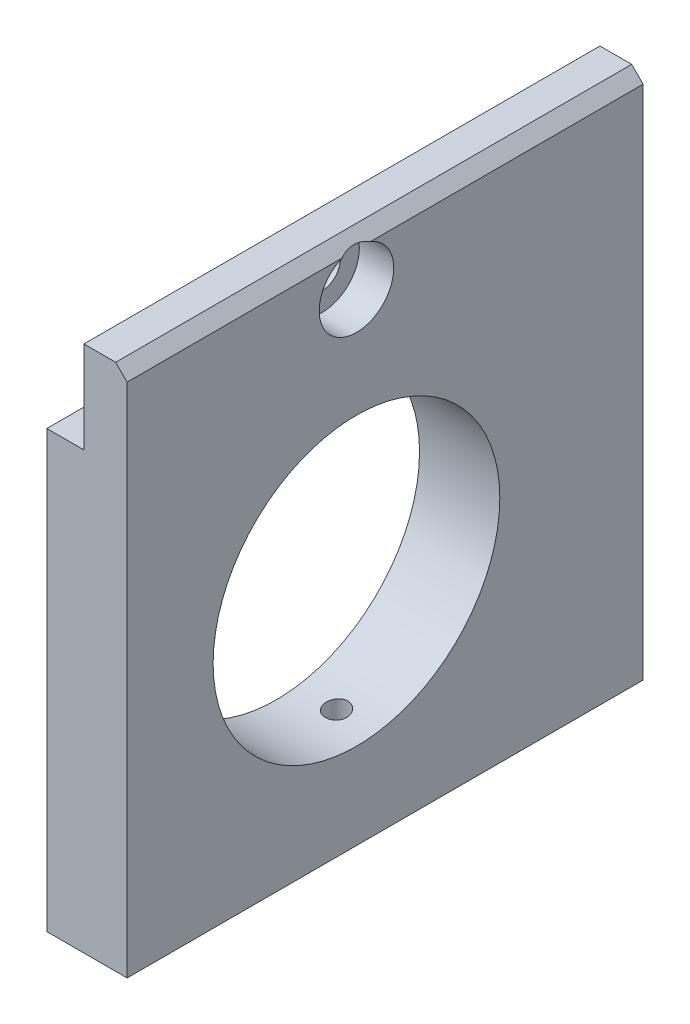
ISO-10303-21;
HEADER;
FILE_DESCRIPTION(('STEP AP214'),'2;1');
FILE_NAME('part.step','',(''),(''),'','','');
FILE_SCHEMA(('AUTOMOTIVE_DESIGN { 1 0 10303 214 1 1 1 1 }'));
ENDSEC;
DATA;
#1=APPLICATION_CONTEXT('core data for automotive mechanical design processes');
#2=APPLICATION_PROTOCOL_DEFINITION('international standard','automotive_design',2000,#1);
#3=PRODUCT_CONTEXT('',#1,'mechanical');
#4=PRODUCT('Part','Part','',(#3));
#5=PRODUCT_RELATED_PRODUCT_CATEGORY('part','',(#4));
#6=PRODUCT_DEFINITION_FORMATION('','',#4);
#7=PRODUCT_DEFINITION_CONTEXT('part definition',#1,'design');
#8=PRODUCT_DEFINITION('design','',#6,#7);
#9=PRODUCT_DEFINITION_SHAPE('','',#8);
#10=(LENGTH_UNIT() NAMED_UNIT(*) SI_UNIT(.MILLI.,.METRE.));
#11=(NAMED_UNIT(*) PLANE_ANGLE_UNIT() SI_UNIT($,.RADIAN.));
#12=(NAMED_UNIT(*) SI_UNIT($,.STERADIAN.) SOLID_ANGLE_UNIT());
#13=UNCERTAINTY_MEASURE_WITH_UNIT(LENGTH_MEASURE(1.E-05),#10,'distance_accuracy_value','');
#14=(GEOMETRIC_REPRESENTATION_CONTEXT(3) GLOBAL_UNCERTAINTY_ASSIGNED_CONTEXT((#13)) GLOBAL_UNIT_ASSIGNED_CONTEXT((#10,
#11,#12)) REPRESENTATION_CONTEXT('',''));
#15=CARTESIAN_POINT('',(0.,0.,0.));
#16=DIRECTION('',(0.,0.,1.));
#17=DIRECTION('',(1.,0.,0.));
#18=AXIS2_PLACEMENT_3D('',#15,#16,#17);
#19=CARTESIAN_POINT('',(0.,-15.6372549019608,45.));
#20=DIRECTION('',(0.,1.,0.));
#21=DIRECTION('',(0.,0.,1.));
#22=AXIS2_PLACEMENT_3D('',#19,#20,#21);
#23=PLANE('',#22);
#24=CARTESIAN_POINT('',(3.5,-15.6372549019608,38.));
#25=DIRECTION('',(0.,-1.,0.));
#26=DIRECTION('',(0.,0.,-1.));
#27=AXIS2_PLACEMENT_3D('',#24,#25,#26);
#28=CIRCLE('',#27,1.49999999999999);
#29=CARTESIAN_POINT('',(3.5,-15.6372549019608,36.5));
#30=VERTEX_POINT('',#29);
#31=EDGE_CURVE('E127',#30,#30,#28,.T.);
#32=ORIENTED_EDGE('',*,*,#31,.F.);
#33=EDGE_LOOP('',(#32));
#34=FACE_BOUND('',#33,.T.);
#35=CARTESIAN_POINT('',(3.5,-15.6372549019608,7.));
#36=DIRECTION('',(0.,-1.,0.));
#37=DIRECTION('',(0.,0.,-1.));
#38=AXIS2_PLACEMENT_3D('',#35,#36,#37);
#39=CIRCLE('',#38,1.49999999999999);
#40=CARTESIAN_POINT('',(3.5,-15.6372549019608,5.50000000000001));
#41=VERTEX_POINT('',#40);
#42=EDGE_CURVE('E126',#41,#41,#39,.T.);
#43=ORIENTED_EDGE('',*,*,#42,.F.);
#44=EDGE_LOOP('',(#43));
#45=FACE_BOUND('',#44,.T.);
#46=DIRECTION('',(1.,0.,0.));
#47=VECTOR('',#46,1.);
#48=CARTESIAN_POINT('',(0.,-15.6372549019608,0.));
#49=LINE('',#48,#47);
#50=CARTESIAN_POINT('',(0.,-15.6372549019608,0.));
#51=VERTEX_POINT('',#50);
#52=CARTESIAN_POINT('',(7.,-15.6372549019608,0.));
#53=VERTEX_POINT('',#52);
#54=EDGE_CURVE('E175',#51,#53,#49,.T.);
#55=ORIENTED_EDGE('',*,*,#54,.T.);
#56=DIRECTION('',(0.,0.,-1.));
#57=VECTOR('',#56,1.);
#58=CARTESIAN_POINT('',(7.,-15.6372549019608,45.));
#59=LINE('',#58,#57);
#60=CARTESIAN_POINT('',(7.,-15.6372549019608,45.));
#61=VERTEX_POINT('',#60);
#62=EDGE_CURVE('E166',#61,#53,#59,.T.);
#63=ORIENTED_EDGE('',*,*,#62,.F.);
#64=DIRECTION('',(1.,0.,0.));
#65=VECTOR('',#64,1.);
#66=CARTESIAN_POINT('',(0.,-15.6372549019608,45.));
#67=LINE('',#66,#65);
#68=CARTESIAN_POINT('',(0.,-15.6372549019608,45.));
#69=VERTEX_POINT('',#68);
#70=EDGE_CURVE('E162',#69,#61,#67,.T.);
#71=ORIENTED_EDGE('',*,*,#70,.F.);
#72=DIRECTION('',(0.,0.,-1.));
#73=VECTOR('',#72,1.);
#74=CARTESIAN_POINT('',(0.,-15.6372549019608,45.));
#75=LINE('',#74,#73);
#76=EDGE_CURVE('E181',#69,#51,#75,.T.);
#77=ORIENTED_EDGE('',*,*,#76,.T.);
#78=EDGE_LOOP('',(#55,#63,#71,#77));
#79=FACE_BOUND('',#78,.T.);
#80=CARTESIAN_POINT('',(3.5,-15.6372549019608,23.));
#81=DIRECTION('',(0.,-1.,0.));
#82=DIRECTION('',(0.,0.,-1.));
#83=AXIS2_PLACEMENT_3D('',#80,#81,#82);
#84=CIRCLE('',#83,1.25);
#85=CARTESIAN_POINT('',(3.5,-15.6372549019608,21.75));
#86=VERTEX_POINT('',#85);
#87=EDGE_CURVE('E417',#86,#86,#84,.T.);
#88=ORIENTED_EDGE('',*,*,#87,.F.);
#89=EDGE_LOOP('',(#88));
#90=FACE_BOUND('',#89,.T.);
#91=ADVANCED_FACE('F40',(#34,#45,#79,#90),#23,.F.);
#92=CARTESIAN_POINT('',(3.23,30.3627450980392,45.));
#93=DIRECTION('',(0.,-1.,0.));
#94=DIRECTION('',(0.,0.,-1.));
#95=AXIS2_PLACEMENT_3D('',#92,#93,#94);
#96=PLANE('',#95);
#97=DIRECTION('',(-1.,0.,0.));
#98=VECTOR('',#97,1.);
#99=CARTESIAN_POINT('',(3.23,30.3627450980392,45.));
#100=LINE('',#99,#98);
#101=CARTESIAN_POINT('',(6.,30.3627450980392,45.));
#102=VERTEX_POINT('',#101);
#103=CARTESIAN_POINT('',(3.23,30.3627450980392,45.));
#104=VERTEX_POINT('',#103);
#105=EDGE_CURVE('E153',#102,#104,#100,.T.);
#106=ORIENTED_EDGE('',*,*,#105,.F.);
#107=DIRECTION('',(0.,0.,-1.));
#108=VECTOR('',#107,1.);
#109=CARTESIAN_POINT('',(6.,30.3627450980392,45.));
#110=LINE('',#109,#108);
#111=CARTESIAN_POINT('',(6.,30.3627450980392,0.));
#112=VERTEX_POINT('',#111);
#113=EDGE_CURVE('E193',#102,#112,#110,.T.);
#114=ORIENTED_EDGE('',*,*,#113,.T.);
#115=DIRECTION('',(-1.,0.,0.));
#116=VECTOR('',#115,1.);
#117=CARTESIAN_POINT('',(3.23,30.3627450980392,0.));
#118=LINE('',#117,#116);
#119=CARTESIAN_POINT('',(3.23,30.3627450980392,0.));
#120=VERTEX_POINT('',#119);
#121=EDGE_CURVE('E167',#112,#120,#118,.T.);
#122=ORIENTED_EDGE('',*,*,#121,.T.);
#123=DIRECTION('',(0.,0.,-1.));
#124=VECTOR('',#123,1.);
#125=CARTESIAN_POINT('',(3.23,30.3627450980392,45.));
#126=LINE('',#125,#124);
#127=EDGE_CURVE('E190',#104,#120,#126,.T.);
#128=ORIENTED_EDGE('',*,*,#127,.F.);
#129=EDGE_LOOP('',(#106,#114,#122,#128));
#130=FACE_BOUND('',#129,.T.);
#131=ADVANCED_FACE('F216',(#130),#96,.F.);
#132=CARTESIAN_POINT('',(3.23,30.3627450980392,45.));
#133=DIRECTION('',(1.,0.,0.));
#134=DIRECTION('',(0.,1.,0.));
#135=AXIS2_PLACEMENT_3D('',#132,#133,#134);
#136=PLANE('',#135);
#137=CARTESIAN_POINT('',(3.23,26.3627450980392,25.));
#138=DIRECTION('',(1.,0.,0.));
#139=DIRECTION('',(0.,1.,0.));
#140=AXIS2_PLACEMENT_3D('',#137,#138,#139);
#141=CIRCLE('',#140,1.6);
#142=CARTESIAN_POINT('',(3.23,27.9627450980392,25.));
#143=VERTEX_POINT('',#142);
#144=EDGE_CURVE('E152',#143,#143,#141,.T.);
#145=ORIENTED_EDGE('',*,*,#144,.T.);
#146=EDGE_LOOP('',(#145));
#147=FACE_BOUND('',#146,.T.);
#148=DIRECTION('',(0.,-1.,0.));
#149=VECTOR('',#148,1.);
#150=CARTESIAN_POINT('',(3.23,30.3627450980392,0.));
#151=LINE('',#150,#149);
#152=CARTESIAN_POINT('',(3.23,22.3627450980392,0.));
#153=VERTEX_POINT('',#152);
#154=EDGE_CURVE('E169',#120,#153,#151,.T.);
#155=ORIENTED_EDGE('',*,*,#154,.T.);
#156=DIRECTION('',(0.,0.,-1.));
#157=VECTOR('',#156,1.);
#158=CARTESIAN_POINT('',(3.23,22.3627450980392,45.));
#159=LINE('',#158,#157);
#160=CARTESIAN_POINT('',(3.23,22.3627450980392,45.));
#161=VERTEX_POINT('',#160);
#162=EDGE_CURVE('E187',#161,#153,#159,.T.);
#163=ORIENTED_EDGE('',*,*,#162,.F.);
#164=DIRECTION('',(0.,-1.,0.));
#165=VECTOR('',#164,1.);
#166=CARTESIAN_POINT('',(3.23,30.3627450980392,45.));
#167=LINE('',#166,#165);
#168=EDGE_CURVE('E155',#104,#161,#167,.T.);
#169=ORIENTED_EDGE('',*,*,#168,.F.);
#170=ORIENTED_EDGE('',*,*,#127,.T.);
#171=EDGE_LOOP('',(#155,#163,#169,#170));
#172=FACE_BOUND('',#171,.T.);
#173=ADVANCED_FACE('F220',(#147,#172),#136,.F.);
#174=CARTESIAN_POINT('',(3.23,22.3627450980392,45.));
#175=DIRECTION('',(0.,-1.,0.));
#176=DIRECTION('',(0.,0.,-1.));
#177=AXIS2_PLACEMENT_3D('',#174,#175,#176);
#178=PLANE('',#177);
#179=DIRECTION('',(-1.,0.,0.));
#180=VECTOR('',#179,1.);
#181=CARTESIAN_POINT('',(3.23,22.3627450980392,0.));
#182=LINE('',#181,#180);
#183=CARTESIAN_POINT('',(0.,22.3627450980392,0.));
#184=VERTEX_POINT('',#183);
#185=EDGE_CURVE('E171',#153,#184,#182,.T.);
#186=ORIENTED_EDGE('',*,*,#185,.T.);
#187=DIRECTION('',(0.,0.,-1.));
#188=VECTOR('',#187,1.);
#189=CARTESIAN_POINT('',(0.,22.3627450980392,45.));
#190=LINE('',#189,#188);
#191=CARTESIAN_POINT('',(0.,22.3627450980392,45.));
#192=VERTEX_POINT('',#191);
#193=EDGE_CURVE('E184',#192,#184,#190,.T.);
#194=ORIENTED_EDGE('',*,*,#193,.F.);
#195=DIRECTION('',(-1.,0.,0.));
#196=VECTOR('',#195,1.);
#197=CARTESIAN_POINT('',(3.23,22.3627450980392,45.));
#198=LINE('',#197,#196);
#199=EDGE_CURVE('E158',#161,#192,#198,.T.);
#200=ORIENTED_EDGE('',*,*,#199,.F.);
#201=ORIENTED_EDGE('',*,*,#162,.T.);
#202=EDGE_LOOP('',(#186,#194,#200,#201));
#203=FACE_BOUND('',#202,.T.);
#204=ADVANCED_FACE('F227',(#203),#178,.F.);
#205=CARTESIAN_POINT('',(0.,22.3627450980392,45.));
#206=DIRECTION('',(1.,0.,0.));
#207=DIRECTION('',(0.,1.,0.));
#208=AXIS2_PLACEMENT_3D('',#205,#206,#207);
#209=PLANE('',#208);
#210=CARTESIAN_POINT('',(0.,4.36274509803914,25.));
#211=DIRECTION('',(1.,0.,0.));
#212=DIRECTION('',(0.,1.,0.));
#213=AXIS2_PLACEMENT_3D('',#210,#211,#212);
#214=CIRCLE('',#213,12.5);
#215=CARTESIAN_POINT('',(0.,16.8627450980391,25.));
#216=VERTEX_POINT('',#215);
#217=EDGE_CURVE('E141',#216,#216,#214,.T.);
#218=ORIENTED_EDGE('',*,*,#217,.T.);
#219=EDGE_LOOP('',(#218));
#220=FACE_BOUND('',#219,.T.);
#221=DIRECTION('',(0.,-1.,0.));
#222=VECTOR('',#221,1.);
#223=CARTESIAN_POINT('',(0.,22.3627450980392,0.));
#224=LINE('',#223,#222);
#225=EDGE_CURVE('E173',#184,#51,#224,.T.);
#226=ORIENTED_EDGE('',*,*,#225,.T.);
#227=ORIENTED_EDGE('',*,*,#76,.F.);
#228=DIRECTION('',(0.,-1.,0.));
#229=VECTOR('',#228,1.);
#230=CARTESIAN_POINT('',(0.,22.3627450980392,45.));
#231=LINE('',#230,#229);
#232=EDGE_CURVE('E160',#192,#69,#231,.T.);
#233=ORIENTED_EDGE('',*,*,#232,.F.);
#234=ORIENTED_EDGE('',*,*,#193,.T.);
#235=EDGE_LOOP('',(#226,#227,#233,#234));
#236=FACE_BOUND('',#235,.T.);
#237=ADVANCED_FACE('F231',(#220,#236),#209,.F.);
#238=CARTESIAN_POINT('',(7.,-15.6372549019608,45.));
#239=DIRECTION('',(-1.,0.,0.));
#240=DIRECTION('',(0.,0.,1.));
#241=AXIS2_PLACEMENT_3D('',#238,#239,#240);
#242=PLANE('',#241);
#243=CARTESIAN_POINT('',(7.,4.36274509803914,25.));
#244=DIRECTION('',(1.,0.,0.));
#245=DIRECTION('',(0.,0.,-1.));
#246=AXIS2_PLACEMENT_3D('',#243,#244,#245);
#247=CIRCLE('',#246,12.5);
#248=CARTESIAN_POINT('',(7.,4.36274509803914,12.5));
#249=VERTEX_POINT('',#248);
#250=EDGE_CURVE('E138',#249,#249,#247,.T.);
#251=ORIENTED_EDGE('',*,*,#250,.F.);
#252=EDGE_LOOP('',(#251));
#253=FACE_BOUND('',#252,.T.);
#254=DIRECTION('',(0.,1.,0.));
#255=VECTOR('',#254,1.);
#256=CARTESIAN_POINT('',(7.,-15.6372549019608,0.));
#257=LINE('',#256,#255);
#258=CARTESIAN_POINT('',(7.,29.3627450980392,0.));
#259=VERTEX_POINT('',#258);
#260=EDGE_CURVE('E156',#53,#259,#257,.T.);
#261=ORIENTED_EDGE('',*,*,#260,.T.);
#262=DIRECTION('',(0.,0.,1.));
#263=VECTOR('',#262,1.);
#264=CARTESIAN_POINT('',(7.,29.3627450980392,45.));
#265=LINE('',#264,#263);
#266=CARTESIAN_POINT('',(7.,29.3627450980392,23.75));
#267=VERTEX_POINT('',#266);
#268=EDGE_CURVE('E201',#259,#267,#265,.T.);
#269=ORIENTED_EDGE('',*,*,#268,.T.);
#270=CARTESIAN_POINT('',(7.,26.3627450980392,25.));
#271=DIRECTION('',(1.,0.,0.));
#272=DIRECTION('',(0.,0.,-1.));
#273=AXIS2_PLACEMENT_3D('',#270,#271,#272);
#274=CIRCLE('',#273,3.25);
#275=CARTESIAN_POINT('',(7.,29.3627450980392,26.25));
#276=VERTEX_POINT('',#275);
#277=EDGE_CURVE('E144',#276,#267,#274,.T.);
#278=ORIENTED_EDGE('',*,*,#277,.F.);
#279=DIRECTION('',(0.,0.,1.));
#280=VECTOR('',#279,1.);
#281=CARTESIAN_POINT('',(7.,29.3627450980392,45.));
#282=LINE('',#281,#280);
#283=CARTESIAN_POINT('',(7.,29.3627450980392,45.));
#284=VERTEX_POINT('',#283);
#285=EDGE_CURVE('E62',#276,#284,#282,.T.);
#286=ORIENTED_EDGE('',*,*,#285,.T.);
#287=DIRECTION('',(0.,1.,0.));
#288=VECTOR('',#287,1.);
#289=CARTESIAN_POINT('',(7.,-15.6372549019608,45.));
#290=LINE('',#289,#288);
#291=EDGE_CURVE('E164',#61,#284,#290,.T.);
#292=ORIENTED_EDGE('',*,*,#291,.F.);
#293=ORIENTED_EDGE('',*,*,#62,.T.);
#294=EDGE_LOOP('',(#261,#269,#278,#286,#292,#293));
#295=FACE_BOUND('',#294,.T.);
#296=ADVANCED_FACE('F204',(#253,#295),#242,.F.);
#297=CARTESIAN_POINT('',(0.,0.,45.));
#298=DIRECTION('',(0.,0.,1.));
#299=DIRECTION('',(1.,0.,0.));
#300=AXIS2_PLACEMENT_3D('',#297,#298,#299);
#301=PLANE('',#300);
#302=ORIENTED_EDGE('',*,*,#291,.T.);
#303=DIRECTION('',(0.707106781186542,-0.707106781186553,0.));
#304=VECTOR('',#303,1.);
#305=CARTESIAN_POINT('',(18.1813725490197,18.1813725490194,45.));
#306=LINE('',#305,#304);
#307=EDGE_CURVE('E11',#284,#102,#306,.F.);
#308=ORIENTED_EDGE('',*,*,#307,.T.);
#309=ORIENTED_EDGE('',*,*,#105,.T.);
#310=ORIENTED_EDGE('',*,*,#168,.T.);
#311=ORIENTED_EDGE('',*,*,#199,.T.);
#312=ORIENTED_EDGE('',*,*,#232,.T.);
#313=ORIENTED_EDGE('',*,*,#70,.T.);
#314=EDGE_LOOP('',(#302,#308,#309,#310,#311,#312,#313));
#315=FACE_BOUND('',#314,.T.);
#316=ADVANCED_FACE('F212',(#315),#301,.T.);
#317=CARTESIAN_POINT('',(0.,0.,0.));
#318=DIRECTION('',(0.,0.,1.));
#319=DIRECTION('',(1.,0.,0.));
#320=AXIS2_PLACEMENT_3D('',#317,#318,#319);
#321=PLANE('',#320);
#322=ORIENTED_EDGE('',*,*,#121,.F.);
#323=DIRECTION('',(-0.707106781186542,0.707106781186553,0.));
#324=VECTOR('',#323,1.);
#325=CARTESIAN_POINT('',(6.,30.3627450980392,0.));
#326=LINE('',#325,#324);
#327=EDGE_CURVE('E198',#112,#259,#326,.F.);
#328=ORIENTED_EDGE('',*,*,#327,.T.);
#329=ORIENTED_EDGE('',*,*,#260,.F.);
#330=ORIENTED_EDGE('',*,*,#54,.F.);
#331=ORIENTED_EDGE('',*,*,#225,.F.);
#332=ORIENTED_EDGE('',*,*,#185,.F.);
#333=ORIENTED_EDGE('',*,*,#154,.F.);
#334=EDGE_LOOP('',(#322,#328,#329,#330,#331,#332,#333));
#335=FACE_BOUND('',#334,.T.);
#336=ADVANCED_FACE('F238',(#335),#321,.F.);
#337=CARTESIAN_POINT('',(7.,26.3627450980392,25.));
#338=DIRECTION('',(1.,0.,0.));
#339=DIRECTION('',(0.,0.,-1.));
#340=AXIS2_PLACEMENT_3D('',#337,#338,#339);
#341=CYLINDRICAL_SURFACE('',#340,1.6);
#342=CARTESIAN_POINT('',(4.,26.3627450980392,25.));
#343=DIRECTION('',(1.,0.,0.));
#344=DIRECTION('',(0.,0.,-1.));
#345=AXIS2_PLACEMENT_3D('',#342,#343,#344);
#346=CIRCLE('',#345,1.6);
#347=CARTESIAN_POINT('',(4.,26.3627450980392,23.4));
#348=VERTEX_POINT('',#347);
#349=EDGE_CURVE('E149',#348,#348,#346,.T.);
#350=ORIENTED_EDGE('',*,*,#349,.T.);
#351=EDGE_LOOP('',(#350));
#352=FACE_BOUND('',#351,.T.);
#353=ORIENTED_EDGE('',*,*,#144,.F.);
#354=EDGE_LOOP('',(#353));
#355=FACE_BOUND('',#354,.T.);
#356=ADVANCED_FACE('F240',(#352,#355),#341,.F.);
#357=CARTESIAN_POINT('',(4.,27.9627450980392,25.));
#358=DIRECTION('',(-1.,0.,0.));
#359=DIRECTION('',(0.,0.,1.));
#360=AXIS2_PLACEMENT_3D('',#357,#358,#359);
#361=PLANE('',#360);
#362=ORIENTED_EDGE('',*,*,#349,.F.);
#363=EDGE_LOOP('',(#362));
#364=FACE_BOUND('',#363,.T.);
#365=CARTESIAN_POINT('',(4.,26.3627450980392,25.));
#366=DIRECTION('',(1.,0.,0.));
#367=DIRECTION('',(0.,0.,-1.));
#368=AXIS2_PLACEMENT_3D('',#365,#366,#367);
#369=CIRCLE('',#368,3.25);
#370=CARTESIAN_POINT('',(4.,26.3627450980392,21.75));
#371=VERTEX_POINT('',#370);
#372=EDGE_CURVE('E146',#371,#371,#369,.T.);
#373=ORIENTED_EDGE('',*,*,#372,.T.);
#374=EDGE_LOOP('',(#373));
#375=FACE_BOUND('',#374,.T.);
#376=ADVANCED_FACE('F246',(#364,#375),#361,.F.);
#377=CARTESIAN_POINT('',(7.,26.3627450980392,25.));
#378=DIRECTION('',(1.,0.,0.));
#379=DIRECTION('',(0.,0.,-1.));
#380=AXIS2_PLACEMENT_3D('',#377,#378,#379);
#381=CYLINDRICAL_SURFACE('',#380,3.25);
#382=ORIENTED_EDGE('',*,*,#372,.F.);
#383=EDGE_LOOP('',(#382));
#384=FACE_BOUND('',#383,.T.);
#385=ORIENTED_EDGE('',*,*,#277,.T.);
#386=CARTESIAN_POINT('',(9.99999999999994,26.3627450980392,25.));
#387=DIRECTION('',(-0.707106781186553,-0.707106781186542,0.));
#388=DIRECTION('',(0.707106781186542,-0.707106781186553,0.));
#389=AXIS2_PLACEMENT_3D('',#386,#387,#388);
#390=ELLIPSE('',#389,4.59619407771252,3.25);
#391=EDGE_CURVE('E55',#267,#276,#390,.F.);
#392=ORIENTED_EDGE('',*,*,#391,.T.);
#393=EDGE_LOOP('',(#385,#392));
#394=FACE_BOUND('',#393,.T.);
#395=ADVANCED_FACE('F207',(#384,#394),#381,.F.);
#396=CARTESIAN_POINT('',(7.,4.36274509803914,25.));
#397=DIRECTION('',(1.,0.,0.));
#398=DIRECTION('',(0.,0.,-1.));
#399=AXIS2_PLACEMENT_3D('',#396,#397,#398);
#400=CYLINDRICAL_SURFACE('',#399,12.5);
#401=CARTESIAN_POINT('',(2.68017444692183,-7.91772656667854,22.6676151331841));
#402=CARTESIAN_POINT('',(2.71449733430034,-7.90899477861498,22.6216411972868));
#403=CARTESIAN_POINT('',(2.7528073794966,-7.90053849948869,22.5785330872446));
#404=CARTESIAN_POINT('',(2.83627858311148,-7.88461670606037,22.4992456635813));
#405=CARTESIAN_POINT('',(2.88144951578472,-7.87715263420129,22.4630764043561));
#406=CARTESIAN_POINT('',(2.97735816070814,-7.86364461114371,22.3987547747403));
#407=CARTESIAN_POINT('',(3.0280939881602,-7.85760018128606,22.3705997015349));
#408=CARTESIAN_POINT('',(3.13371378924814,-7.84730315513873,22.3231896124978));
#409=CARTESIAN_POINT('',(3.18859584540166,-7.843049736481,22.3039305115604));
#410=CARTESIAN_POINT('',(3.3001552492553,-7.83665921789998,22.2751604858859));
#411=CARTESIAN_POINT('',(3.35679659478484,-7.83449325656802,22.2655165543062));
#412=CARTESIAN_POINT('',(3.4709354785402,-7.83232350233439,22.2558557496301));
#413=CARTESIAN_POINT('',(3.52843295260088,-7.83231954820213,22.2558381586545));
#414=CARTESIAN_POINT('',(3.64143773173106,-7.83445188344593,22.2653323344969));
#415=CARTESIAN_POINT('',(3.6969618838883,-7.83654567251597,22.2746548702142));
#416=CARTESIAN_POINT('',(3.80563507487172,-7.84267125204759,22.3022214578336));
#417=CARTESIAN_POINT('',(3.85878401396818,-7.84670312380138,22.3204658839619));
#418=CARTESIAN_POINT('',(3.96159641274279,-7.85648423972063,22.3654290481395));
#419=CARTESIAN_POINT('',(4.0112356368714,-7.86224421046704,22.3922007824709));
#420=CARTESIAN_POINT('',(4.10535985309378,-7.87513634806563,22.4533880539203));
#421=CARTESIAN_POINT('',(4.14984403814996,-7.88226872930925,22.4878047854332));
#422=CARTESIAN_POINT('',(4.23343821338795,-7.89769893081678,22.5642122039284));
#423=CARTESIAN_POINT('',(4.27240292381581,-7.90601957262362,22.6063573802886));
#424=CARTESIAN_POINT('',(4.34260973009434,-7.92327282589485,22.6965529109891));
#425=CARTESIAN_POINT('',(4.37385123044088,-7.9322054844815,22.7446037202603));
#426=CARTESIAN_POINT('',(4.42764692926339,-7.95027605240175,22.8454385491182));
#427=CARTESIAN_POINT('',(4.45018506330524,-7.95941430864561,22.8982311016862));
#428=CARTESIAN_POINT('',(4.48559950223203,-7.9774735911362,23.0070031345992));
#429=CARTESIAN_POINT('',(4.49847807972096,-7.98639466800055,23.0629818619963));
#430=CARTESIAN_POINT('',(4.51363492187157,-8.00334674381732,23.1743952745793));
#431=CARTESIAN_POINT('',(4.51627806083598,-8.01139822267228,23.2297770135486));
#432=CARTESIAN_POINT('',(4.51167651416967,-8.02669769511212,23.3402371580141));
#433=CARTESIAN_POINT('',(4.50443509286354,-8.03394595310195,23.3953156576232));
#434=CARTESIAN_POINT('',(4.48073198767829,-8.04715050800129,23.5009343351476));
#435=CARTESIAN_POINT('',(4.4647048870802,-8.05315058790018,23.5515669770866));
#436=CARTESIAN_POINT('',(4.42421871955257,-8.06417876395764,23.6494480443823));
#437=CARTESIAN_POINT('',(4.39976049520824,-8.06920695716577,23.6966968073456));
#438=CARTESIAN_POINT('',(4.34357367372704,-8.0782345670319,23.7859101271388));
#439=CARTESIAN_POINT('',(4.31194046986511,-8.08224613697015,23.8279337137026));
#440=CARTESIAN_POINT('',(4.24224540090339,-8.08938155224571,23.9063388073938));
#441=CARTESIAN_POINT('',(4.20418273887045,-8.09250528740673,23.9427196140234));
#442=CARTESIAN_POINT('',(4.12145000369359,-8.09804606220587,24.0101177006223));
#443=CARTESIAN_POINT('',(4.07660586922346,-8.10043693937522,24.0409231270393));
#444=CARTESIAN_POINT('',(3.98258977013067,-8.10448532264552,24.0950664997627));
#445=CARTESIAN_POINT('',(3.93341670804302,-8.10614264213011,24.1184025454482));
#446=CARTESIAN_POINT('',(3.82921499664613,-8.10890110372665,24.1582959186771));
#447=CARTESIAN_POINT('',(3.7740127159001,-8.10996605711768,24.1744024131172));
#448=CARTESIAN_POINT('',(3.66173374080699,-8.11147934394258,24.1975913482529));
#449=CARTESIAN_POINT('',(3.60465654917934,-8.11192751241295,24.2046713747185));
#450=CARTESIAN_POINT('',(3.48749122138321,-8.11225441607156,24.2098125989024));
#451=CARTESIAN_POINT('',(3.42738399487148,-8.11210638611543,24.2074499209173));
#452=CARTESIAN_POINT('',(3.30839169991369,-8.111165378069,24.1927761417453));
#453=CARTESIAN_POINT('',(3.24950679029408,-8.11037231669541,24.1804637559022));
#454=CARTESIAN_POINT('',(3.13423116012274,-8.10805777206987,24.1459649654673));
#455=CARTESIAN_POINT('',(3.07786199693391,-8.10653096838364,24.1237065251805));
#456=CARTESIAN_POINT('',(2.9698745946324,-8.1026196942916,24.0697262192639));
#457=CARTESIAN_POINT('',(2.91825546162773,-8.10023538567293,24.038006138973));
#458=CARTESIAN_POINT('',(2.8233759346148,-8.09456222486942,23.9671861546964));
#459=CARTESIAN_POINT('',(2.77987593314204,-8.09131034396065,23.9284048805065));
#460=CARTESIAN_POINT('',(2.70053149599521,-8.0837366702219,23.8437605986645));
#461=CARTESIAN_POINT('',(2.66468386660977,-8.07941532536423,23.7979005591531));
#462=CARTESIAN_POINT('',(2.60385135724454,-8.06990422035692,23.7033299854992));
#463=CARTESIAN_POINT('',(2.57835495445387,-8.06477979028585,23.6549415902143));
#464=CARTESIAN_POINT('',(2.53625523674951,-8.05350399306194,23.5545576544538));
#465=CARTESIAN_POINT('',(2.51964921117863,-8.04735293967555,23.5025632189198));
#466=CARTESIAN_POINT('',(2.49628703946697,-8.03435774964604,23.3986001861104));
#467=CARTESIAN_POINT('',(2.48918176571036,-8.02754867180669,23.3467051446976));
#468=CARTESIAN_POINT('',(2.4837643765983,-8.01320452901377,23.2425488950496));
#469=CARTESIAN_POINT('',(2.48545455815437,-8.00566927492535,23.1902875947255));
#470=CARTESIAN_POINT('',(2.49746113009456,-7.990024989028,23.0864021657858));
#471=CARTESIAN_POINT('',(2.5078515417029,-7.98191158206171,23.034787375096));
#472=CARTESIAN_POINT('',(2.5368689890951,-7.96544663924268,22.9340154110813));
#473=CARTESIAN_POINT('',(2.55548835104002,-7.95709533201405,22.8848559954433));
#474=CARTESIAN_POINT('',(2.59203513216425,-7.943524233749,22.8075896141937));
#475=CARTESIAN_POINT('',(2.60769747648452,-7.93828259548225,22.7783906208909));
#476=CARTESIAN_POINT('',(2.64185457765149,-7.92790551965729,22.7216807309596));
#477=CARTESIAN_POINT('',(2.66034940118711,-7.9227700846028,22.6941698740986));
#478=CARTESIAN_POINT('',(2.68017444692183,-7.91772656667854,22.6676151331841));
#479=B_SPLINE_CURVE_WITH_KNOTS('',3,(#401,#402,#403,#404,#405,#406,#407,#408,#409,#410,#411,
#412,#413,#414,#415,#416,#417,#418,#419,#420,#421,#422,#423,#424,#425,#426,#427,#428,#429,#430,
#431,#432,#433,#434,#435,#436,#437,#438,#439,#440,#441,#442,#443,#444,#445,#446,#447,#448,#449,
#450,#451,#452,#453,#454,#455,#456,#457,#458,#459,#460,#461,#462,#463,#464,#465,#466,#467,#468,
#469,#470,#471,#472,#473,#474,#475,#476,#477,#478),.UNSPECIFIED.,.T.,.F.,(4,2,2,2,2,2,2,2,2,2,2,
2,2,2,2,2,2,2,2,2,2,2,2,2,2,2,2,2,2,2,2,2,2,2,2,2,2,2,4),(0.,0.173978367593874,
0.348206956678378,0.522376716696557,0.696466416777907,0.86811305396455,1.03974689068995,
1.20797234972775,1.37620486554025,1.54550402632433,1.7148296557208,1.88800729383487,
2.06119828078391,2.23470742811488,2.40817574113066,2.57540002558267,2.74256909844379,
2.90213079770481,3.06167655539349,3.21921398695067,3.37677095966461,3.53943041452626,
3.70213122604709,3.87390936578286,4.04573343987695,4.22535526467653,4.40500028504623,
4.5859680464475,4.76690168219768,4.94110078172977,5.11522703665095,5.27919999371294,
5.4431229272537,5.60083947299189,5.75859720808454,5.91771094100469,6.07667660580295,
6.17716488460714,6.27765552970828),.UNSPECIFIED.);
#480=CARTESIAN_POINT('',(2.68017444692183,-7.91772656667854,22.6676151331841));
#481=VERTEX_POINT('',#480);
#482=EDGE_CURVE('E45',#481,#481,#479,.T.);
#483=ORIENTED_EDGE('',*,*,#482,.T.);
#484=EDGE_LOOP('',(#483));
#485=FACE_BOUND('',#484,.T.);
#486=ORIENTED_EDGE('',*,*,#217,.F.);
#487=EDGE_LOOP('',(#486));
#488=FACE_BOUND('',#487,.T.);
#489=ORIENTED_EDGE('',*,*,#250,.T.);
#490=EDGE_LOOP('',(#489));
#491=FACE_BOUND('',#490,.T.);
#492=ADVANCED_FACE('F307',(#485,#488,#491),#400,.F.);
#493=CARTESIAN_POINT('',(6.,30.3627450980392,45.));
#494=DIRECTION('',(-0.707106781186553,-0.707106781186542,0.));
#495=DIRECTION('',(0.,0.,-1.));
#496=AXIS2_PLACEMENT_3D('',#493,#494,#495);
#497=PLANE('',#496);
#498=ORIENTED_EDGE('',*,*,#391,.F.);
#499=ORIENTED_EDGE('',*,*,#268,.F.);
#500=ORIENTED_EDGE('',*,*,#327,.F.);
#501=ORIENTED_EDGE('',*,*,#113,.F.);
#502=ORIENTED_EDGE('',*,*,#307,.F.);
#503=ORIENTED_EDGE('',*,*,#285,.F.);
#504=EDGE_LOOP('',(#498,#499,#500,#501,#502,#503));
#505=FACE_BOUND('',#504,.T.);
#506=ADVANCED_FACE('F43',(#505),#497,.F.);
#507=CARTESIAN_POINT('',(3.5,-11.1372549019608,7.));
#508=DIRECTION('',(0.,-1.,0.));
#509=DIRECTION('',(0.,0.,-1.));
#510=AXIS2_PLACEMENT_3D('',#507,#508,#509);
#511=CONICAL_SURFACE('',#510,1.5,1.02974425867665);
#512=CARTESIAN_POINT('',(3.5,-10.2359639734194,7.));
#513=VERTEX_POINT('',#512);
#514=VERTEX_LOOP('',#513);
#515=FACE_BOUND('',#514,.T.);
#516=CARTESIAN_POINT('',(3.5,-11.1372549019608,7.));
#517=DIRECTION('',(0.,-1.,0.));
#518=DIRECTION('',(0.,0.,-1.));
#519=AXIS2_PLACEMENT_3D('',#516,#517,#518);
#520=CIRCLE('',#519,1.5);
#521=CARTESIAN_POINT('',(3.5,-11.1372549019608,5.5));
#522=VERTEX_POINT('',#521);
#523=EDGE_CURVE('E130',#522,#522,#520,.T.);
#524=ORIENTED_EDGE('',*,*,#523,.T.);
#525=EDGE_LOOP('',(#524));
#526=FACE_BOUND('',#525,.T.);
#527=ADVANCED_FACE('F321',(#515,#526),#511,.F.);
#528=CARTESIAN_POINT('',(3.5,-15.6372549019608,7.));
#529=DIRECTION('',(0.,-1.,0.));
#530=DIRECTION('',(0.,0.,-1.));
#531=AXIS2_PLACEMENT_3D('',#528,#529,#530);
#532=CYLINDRICAL_SURFACE('',#531,1.49999999999999);
#533=ORIENTED_EDGE('',*,*,#523,.F.);
#534=EDGE_LOOP('',(#533));
#535=FACE_BOUND('',#534,.T.);
#536=ORIENTED_EDGE('',*,*,#42,.T.);
#537=EDGE_LOOP('',(#536));
#538=FACE_BOUND('',#537,.T.);
#539=ADVANCED_FACE('F120',(#535,#538),#532,.F.);
#540=CARTESIAN_POINT('',(3.5,-11.1372549019608,38.));
#541=DIRECTION('',(0.,-1.,0.));
#542=DIRECTION('',(0.,0.,-1.));
#543=AXIS2_PLACEMENT_3D('',#540,#541,#542);
#544=CONICAL_SURFACE('',#543,1.5,1.02974425867665);
#545=CARTESIAN_POINT('',(3.5,-10.2359639734194,38.));
#546=VERTEX_POINT('',#545);
#547=VERTEX_LOOP('',#546);
#548=FACE_BOUND('',#547,.T.);
#549=CARTESIAN_POINT('',(3.5,-11.1372549019608,38.));
#550=DIRECTION('',(0.,-1.,0.));
#551=DIRECTION('',(0.,0.,-1.));
#552=AXIS2_PLACEMENT_3D('',#549,#550,#551);
#553=CIRCLE('',#552,1.5);
#554=CARTESIAN_POINT('',(3.5,-11.1372549019608,36.5));
#555=VERTEX_POINT('',#554);
#556=EDGE_CURVE('E124',#555,#555,#553,.T.);
#557=ORIENTED_EDGE('',*,*,#556,.T.);
#558=EDGE_LOOP('',(#557));
#559=FACE_BOUND('',#558,.T.);
#560=ADVANCED_FACE('F116',(#548,#559),#544,.F.);
#561=CARTESIAN_POINT('',(3.5,-15.6372549019608,38.));
#562=DIRECTION('',(0.,-1.,0.));
#563=DIRECTION('',(0.,0.,-1.));
#564=AXIS2_PLACEMENT_3D('',#561,#562,#563);
#565=CYLINDRICAL_SURFACE('',#564,1.49999999999999);
#566=ORIENTED_EDGE('',*,*,#556,.F.);
#567=EDGE_LOOP('',(#566));
#568=FACE_BOUND('',#567,.T.);
#569=ORIENTED_EDGE('',*,*,#31,.T.);
#570=EDGE_LOOP('',(#569));
#571=FACE_BOUND('',#570,.T.);
#572=ADVANCED_FACE('F119',(#568,#571),#565,.F.);
#573=CARTESIAN_POINT('',(3.5,-8.13725490196078,23.));
#574=DIRECTION('',(0.,-1.,0.));
#575=DIRECTION('',(0.,0.,-1.));
#576=AXIS2_PLACEMENT_3D('',#573,#574,#575);
#577=CONICAL_SURFACE('',#576,1.25,1.02974425867665);
#578=CARTESIAN_POINT('',(3.5,-8.13725490196078,23.));
#579=DIRECTION('',(0.,-1.,0.));
#580=DIRECTION('',(0.,0.,-1.));
#581=AXIS2_PLACEMENT_3D('',#578,#579,#580);
#582=CIRCLE('',#581,1.25);
#583=CARTESIAN_POINT('',(3.5,-8.13725490196078,21.75));
#584=VERTEX_POINT('',#583);
#585=EDGE_CURVE('E414',#584,#584,#582,.T.);
#586=ORIENTED_EDGE('',*,*,#585,.T.);
#587=EDGE_LOOP('',(#586));
#588=FACE_BOUND('',#587,.T.);
#589=ORIENTED_EDGE('',*,*,#482,.F.);
#590=EDGE_LOOP('',(#589));
#591=FACE_BOUND('',#590,.T.);
#592=ADVANCED_FACE('F353',(#588,#591),#577,.F.);
#593=CARTESIAN_POINT('',(3.5,-15.6372549019608,23.));
#594=DIRECTION('',(0.,-1.,0.));
#595=DIRECTION('',(0.,0.,-1.));
#596=AXIS2_PLACEMENT_3D('',#593,#594,#595);
#597=CYLINDRICAL_SURFACE('',#596,1.25);
#598=ORIENTED_EDGE('',*,*,#585,.F.);
#599=EDGE_LOOP('',(#598));
#600=FACE_BOUND('',#599,.T.);
#601=ORIENTED_EDGE('',*,*,#87,.T.);
#602=EDGE_LOOP('',(#601));
#603=FACE_BOUND('',#602,.T.);
#604=ADVANCED_FACE('F374',(#600,#603),#597,.F.);
#605=CLOSED_SHELL('',(#91,#131,#173,#204,#237,#296,#316,#336,#356,#376,#395,#492,#506,#527,#539,
#560,#572,#592,#604));
#606=MANIFOLD_SOLID_BREP('B2',#605);
#607=ADVANCED_BREP_SHAPE_REPRESENTATION('',(#18,#606),#14);
#608=SHAPE_DEFINITION_REPRESENTATION(#9,#607);
ENDSEC;
END-ISO-10303-21;
